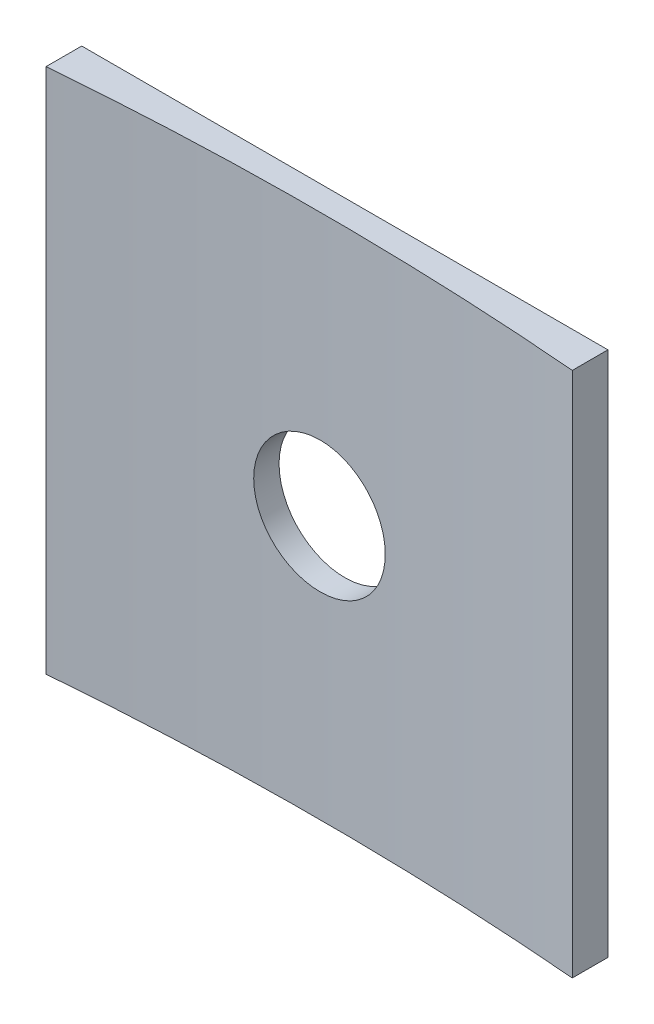
ISO-10303-21;
HEADER;
FILE_DESCRIPTION(('STEP AP214'),'2;1');
FILE_NAME('part.step','',(''),(''),'','','');
FILE_SCHEMA(('AUTOMOTIVE_DESIGN { 1 0 10303 214 1 1 1 1 }'));
ENDSEC;
DATA;
#1=APPLICATION_CONTEXT('core data for automotive mechanical design processes');
#2=APPLICATION_PROTOCOL_DEFINITION('international standard','automotive_design',2000,#1);
#3=PRODUCT_CONTEXT('',#1,'mechanical');
#4=PRODUCT('Part','Part','',(#3));
#5=PRODUCT_RELATED_PRODUCT_CATEGORY('part','',(#4));
#6=PRODUCT_DEFINITION_FORMATION('','',#4);
#7=PRODUCT_DEFINITION_CONTEXT('part definition',#1,'design');
#8=PRODUCT_DEFINITION('design','',#6,#7);
#9=PRODUCT_DEFINITION_SHAPE('','',#8);
#10=(LENGTH_UNIT() NAMED_UNIT(*) SI_UNIT(.MILLI.,.METRE.));
#11=(NAMED_UNIT(*) PLANE_ANGLE_UNIT() SI_UNIT($,.RADIAN.));
#12=(NAMED_UNIT(*) SI_UNIT($,.STERADIAN.) SOLID_ANGLE_UNIT());
#13=UNCERTAINTY_MEASURE_WITH_UNIT(LENGTH_MEASURE(1.E-05),#10,'distance_accuracy_value','');
#14=(GEOMETRIC_REPRESENTATION_CONTEXT(3) GLOBAL_UNCERTAINTY_ASSIGNED_CONTEXT((#13)) GLOBAL_UNIT_ASSIGNED_CONTEXT((#10,
#11,#12)) REPRESENTATION_CONTEXT('',''));
#15=CARTESIAN_POINT('',(0.,0.,0.));
#16=DIRECTION('',(0.,0.,1.));
#17=DIRECTION('',(1.,0.,0.));
#18=AXIS2_PLACEMENT_3D('',#15,#16,#17);
#19=CARTESIAN_POINT('',(0.,-25.4,0.));
#20=DIRECTION('',(0.,1.,0.));
#21=DIRECTION('',(0.,0.,1.));
#22=AXIS2_PLACEMENT_3D('',#19,#20,#21);
#23=CYLINDRICAL_SURFACE('',#22,152.4);
#24=CARTESIAN_POINT('',(-3.175,-12.7,-152.366923493913));
#25=CARTESIAN_POINT('',(-3.1749920986252,-12.8783203798337,-152.366923940762));
#26=CARTESIAN_POINT('',(-3.15992683175384,-13.0567695662421,-152.367239897938));
#27=CARTESIAN_POINT('',(-3.1000383491932,-13.4087519311199,-152.36846991657));
#28=CARTESIAN_POINT('',(-3.05517944647312,-13.5822789535593,-152.36938469528));
#29=CARTESIAN_POINT('',(-2.93698255450984,-13.9192668049938,-152.371708684941));
#30=CARTESIAN_POINT('',(-2.86365832693572,-14.0827324540227,-152.37311765694));
#31=CARTESIAN_POINT('',(-2.69063149875452,-14.3949882174427,-152.376270963536));
#32=CARTESIAN_POINT('',(-2.59093539949493,-14.5437819364496,-152.378015215448));
#33=CARTESIAN_POINT('',(-2.36795868767862,-14.8225601356859,-152.381643153922));
#34=CARTESIAN_POINT('',(-2.24467241532279,-14.9525400889091,-152.383526873878));
#35=CARTESIAN_POINT('',(-1.97802331457526,-15.1899635508147,-152.387221133212));
#36=CARTESIAN_POINT('',(-1.83465969279886,-15.2974061684833,-152.389031669694));
#37=CARTESIAN_POINT('',(-1.53191601878581,-15.486706384046,-152.392375519086));
#38=CARTESIAN_POINT('',(-1.372534809831,-15.5685621324144,-152.393908811953));
#39=CARTESIAN_POINT('',(-1.04228863671553,-15.7043526227995,-152.396525138538));
#40=CARTESIAN_POINT('',(-0.871423706708971,-15.7582874478525,-152.397608173595));
#41=CARTESIAN_POINT('',(-0.52308649704307,-15.836697725036,-152.399201752784));
#42=CARTESIAN_POINT('',(-0.345615180660369,-15.8611774548002,-152.399712380045));
#43=CARTESIAN_POINT('',(0.0109186159938498,-15.8799957970201,-152.400103857121));
#44=CARTESIAN_POINT('',(0.189981091717756,-15.8743344955927,-152.399984708736));
#45=CARTESIAN_POINT('',(0.54458524211617,-15.8330351861322,-152.399130139551));
#46=CARTESIAN_POINT('',(0.720127457995702,-15.7974018227461,-152.398394814236));
#47=CARTESIAN_POINT('',(1.06273772421929,-15.6971770586899,-152.396390888777));
#48=CARTESIAN_POINT('',(1.22980576093812,-15.6325856114612,-152.395122287775));
#49=CARTESIAN_POINT('',(1.5507399909113,-15.4762728840765,-152.392194648686));
#50=CARTESIAN_POINT('',(1.70460514634153,-15.3845494737043,-152.390535579945));
#51=CARTESIAN_POINT('',(1.99475447265447,-15.1765781559269,-152.387014017177));
#52=CARTESIAN_POINT('',(2.13103862784003,-15.0603302266253,-152.385151522969));
#53=CARTESIAN_POINT('',(2.38218444686974,-14.8065834146978,-152.381432632009));
#54=CARTESIAN_POINT('',(2.49704203268128,-14.6690804957832,-152.379576236485));
#55=CARTESIAN_POINT('',(2.70204289911422,-14.376741204736,-152.376079192425));
#56=CARTESIAN_POINT('',(2.79218617615158,-14.2219048300897,-152.37443854392));
#57=CARTESIAN_POINT('',(2.94519907076089,-13.8992916950645,-152.371558001611));
#58=CARTESIAN_POINT('',(3.0080685628991,-13.7315148751759,-152.370318109648));
#59=CARTESIAN_POINT('',(3.10474663395198,-13.3877845080458,-152.368378957879));
#60=CARTESIAN_POINT('',(3.13855525171725,-13.2118309717359,-152.36767969735));
#61=CARTESIAN_POINT('',(3.17614686990949,-12.8567773711966,-152.366900777384));
#62=CARTESIAN_POINT('',(3.17993551495527,-12.6776779048402,-152.366821001466));
#63=CARTESIAN_POINT('',(3.1573943437747,-12.3213853649273,-152.367289741507));
#64=CARTESIAN_POINT('',(3.13106454366545,-12.1441922903507,-152.36783825713));
#65=CARTESIAN_POINT('',(3.04903857048439,-11.796758190714,-152.369501636592));
#66=CARTESIAN_POINT('',(2.99334495657732,-11.6265165612028,-152.370616451077));
#67=CARTESIAN_POINT('',(2.85417491731163,-11.2977994273624,-152.373286705928));
#68=CARTESIAN_POINT('',(2.77069846682816,-11.1393239336739,-152.374842146693));
#69=CARTESIAN_POINT('',(2.57831781837455,-10.8386116628775,-152.378218584074));
#70=CARTESIAN_POINT('',(2.46940981749153,-10.6963773191347,-152.380039620391));
#71=CARTESIAN_POINT('',(2.22926317456083,-10.4322093183167,-152.383741810638));
#72=CARTESIAN_POINT('',(2.09802450037049,-10.3102756904627,-152.385622964656));
#73=CARTESIAN_POINT('',(1.8169177849111,-10.090151637434,-152.38923365395));
#74=CARTESIAN_POINT('',(1.66704689141537,-9.99196485422721,-152.390963165945));
#75=CARTESIAN_POINT('',(1.35294475663512,-9.82214663581258,-152.39407526353));
#76=CARTESIAN_POINT('',(1.18871353881953,-9.75051515720666,-152.395457849686));
#77=CARTESIAN_POINT('',(0.850566469601386,-9.63584725415542,-152.397720120313));
#78=CARTESIAN_POINT('',(0.676651422467755,-9.59280845883615,-152.398599846479));
#79=CARTESIAN_POINT('',(0.324061974118008,-9.53653984473758,-152.399757387774));
#80=CARTESIAN_POINT('',(0.145387570469758,-9.52331004119163,-152.400035202594));
#81=CARTESIAN_POINT('',(-0.211611865014944,-9.52703529544678,-152.399957603087));
#82=CARTESIAN_POINT('',(-0.389936957071266,-9.54398458755496,-152.399602309715));
#83=CARTESIAN_POINT('',(-0.741210124178171,-9.60757510460974,-152.398298776041));
#84=CARTESIAN_POINT('',(-0.914158188486152,-9.65421638887308,-152.397350534555));
#85=CARTESIAN_POINT('',(-1.24977155098012,-9.77586668685811,-152.394967951465));
#86=CARTESIAN_POINT('',(-1.4124366640485,-9.85087621110601,-152.393533601114));
#87=CARTESIAN_POINT('',(-1.7228600606918,-10.0271300866237,-152.390340503903));
#88=CARTESIAN_POINT('',(-1.87061890697541,-10.1283734470559,-152.388581769296));
#89=CARTESIAN_POINT('',(-2.14705798542837,-10.3542316746816,-152.384937868475));
#90=CARTESIAN_POINT('',(-2.27573660154825,-10.4788485195305,-152.38305269157));
#91=CARTESIAN_POINT('',(-2.51038012985537,-10.747952871158,-152.379368034243));
#92=CARTESIAN_POINT('',(-2.61633939894465,-10.8924453000967,-152.377568575197));
#93=CARTESIAN_POINT('',(-2.80254543733462,-11.197239434375,-152.374257813369));
#94=CARTESIAN_POINT('',(-2.88277778510863,-11.3575499411138,-152.372746672397));
#95=CARTESIAN_POINT('',(-3.0150965250472,-11.6892440011975,-152.370186106662));
#96=CARTESIAN_POINT('',(-3.06721657302619,-11.8606140375961,-152.369136130076));
#97=CARTESIAN_POINT('',(-3.12797806838276,-12.1442263371796,-152.367897733141));
#98=CARTESIAN_POINT('',(-3.14558919908283,-12.2546266886159,-152.367533973729));
#99=CARTESIAN_POINT('',(-3.16910263859059,-12.4766678491507,-152.367046714189));
#100=CARTESIAN_POINT('',(-3.17500494904259,-12.588308658075,-152.366923214029));
#101=CARTESIAN_POINT('',(-3.175,-12.7,-152.366923493913));
#102=B_SPLINE_CURVE_WITH_KNOTS('',3,(#24,#25,#26,#27,#28,#29,#30,#31,#32,#33,#34,#35,#36,#37,
#38,#39,#40,#41,#42,#43,#44,#45,#46,#47,#48,#49,#50,#51,#52,#53,#54,#55,#56,#57,#58,#59,#60,#61,
#62,#63,#64,#65,#66,#67,#68,#69,#70,#71,#72,#73,#74,#75,#76,#77,#78,#79,#80,#81,#82,#83,#84,#85,
#86,#87,#88,#89,#90,#91,#92,#93,#94,#95,#96,#97,#98,#99,#100,#101),.UNSPECIFIED.,.T.,.F.,(4,2,2,
2,2,2,2,2,2,2,2,2,2,2,2,2,2,2,2,2,2,2,2,2,2,2,2,2,2,2,2,2,2,2,2,2,2,2,4),(0.,0.534553459243709,
1.06974836800196,1.60468485633052,2.13948959170376,2.67442279969665,3.20937715229556,
3.74437016469157,4.27936158601811,4.81427530351562,5.3491874926945,5.8840168040057,
6.41884697521621,6.95371914878561,7.48859179991102,8.0235661475625,8.55854057279524,
9.09351745838061,9.62849362877031,10.1633692058565,10.6982444967182,11.2330731789282,
11.7679023448013,12.302811537752,12.8377215006549,13.3727134488225,13.9077045226743,
14.4426512301139,14.9775982109282,15.5124430015009,16.0472888605551,16.5821443453676,
17.1169796319278,17.6518601919033,18.1868734535705,18.7221861010044,19.2568564459882,
19.5916751674029,19.9264938417982),.UNSPECIFIED.);
#103=CARTESIAN_POINT('',(-3.175,-12.7,-152.366923493913));
#104=VERTEX_POINT('',#103);
#105=EDGE_CURVE('E113',#104,#104,#102,.T.);
#106=ORIENTED_EDGE('',*,*,#105,.F.);
#107=EDGE_LOOP('',(#106));
#108=FACE_BOUND('',#107,.T.);
#109=CARTESIAN_POINT('',(0.,0.,0.));
#110=DIRECTION('',(0.,-1.,0.));
#111=DIRECTION('',(0.,0.,1.));
#112=AXIS2_PLACEMENT_3D('',#109,#110,#111);
#113=CIRCLE('',#112,152.4);
#114=CARTESIAN_POINT('',(-12.7,0.,-151.869911437388));
#115=VERTEX_POINT('',#114);
#116=CARTESIAN_POINT('',(12.7,0.,-151.869911437388));
#117=VERTEX_POINT('',#116);
#118=EDGE_CURVE('E104',#115,#117,#113,.T.);
#119=ORIENTED_EDGE('',*,*,#118,.F.);
#120=DIRECTION('',(0.,1.,0.));
#121=VECTOR('',#120,1.);
#122=CARTESIAN_POINT('',(-12.7,-25.4,-151.869911437388));
#123=LINE('',#122,#121);
#124=CARTESIAN_POINT('',(-12.7,-25.4,-151.869911437388));
#125=VERTEX_POINT('',#124);
#126=EDGE_CURVE('E11',#125,#115,#123,.T.);
#127=ORIENTED_EDGE('',*,*,#126,.F.);
#128=CARTESIAN_POINT('',(0.,-25.4,0.));
#129=DIRECTION('',(0.,-1.,0.));
#130=DIRECTION('',(0.,0.,-1.));
#131=AXIS2_PLACEMENT_3D('',#128,#129,#130);
#132=CIRCLE('',#131,152.4);
#133=CARTESIAN_POINT('',(12.7,-25.4,-151.869911437388));
#134=VERTEX_POINT('',#133);
#135=EDGE_CURVE('E59',#125,#134,#132,.T.);
#136=ORIENTED_EDGE('',*,*,#135,.T.);
#137=DIRECTION('',(0.,1.,0.));
#138=VECTOR('',#137,1.);
#139=CARTESIAN_POINT('',(12.7,-25.4,-151.869911437388));
#140=LINE('',#139,#138);
#141=EDGE_CURVE('E43',#134,#117,#140,.T.);
#142=ORIENTED_EDGE('',*,*,#141,.T.);
#143=EDGE_LOOP('',(#119,#127,#136,#142));
#144=FACE_BOUND('',#143,.T.);
#145=ADVANCED_FACE('F39',(#108,#144),#23,.F.);
#146=CARTESIAN_POINT('',(-12.7,-25.4,-151.869911437388));
#147=DIRECTION('',(-1.,0.,0.));
#148=DIRECTION('',(0.,0.,1.));
#149=AXIS2_PLACEMENT_3D('',#146,#147,#148);
#150=PLANE('',#149);
#151=DIRECTION('',(0.,0.,1.));
#152=VECTOR('',#151,1.);
#153=CARTESIAN_POINT('',(-12.7,0.,-151.869911437388));
#154=LINE('',#153,#152);
#155=CARTESIAN_POINT('',(-12.7,0.,-153.590837637388));
#156=VERTEX_POINT('',#155);
#157=EDGE_CURVE('E116',#156,#115,#154,.T.);
#158=ORIENTED_EDGE('',*,*,#157,.F.);
#159=DIRECTION('',(0.,1.,0.));
#160=VECTOR('',#159,1.);
#161=CARTESIAN_POINT('',(-12.7,-25.4,-153.590837637388));
#162=LINE('',#161,#160);
#163=CARTESIAN_POINT('',(-12.7,-25.4,-153.590837637388));
#164=VERTEX_POINT('',#163);
#165=EDGE_CURVE('E50',#164,#156,#162,.T.);
#166=ORIENTED_EDGE('',*,*,#165,.F.);
#167=DIRECTION('',(0.,0.,1.));
#168=VECTOR('',#167,1.);
#169=CARTESIAN_POINT('',(-12.7,-25.4,-151.869911437388));
#170=LINE('',#169,#168);
#171=EDGE_CURVE('E98',#164,#125,#170,.T.);
#172=ORIENTED_EDGE('',*,*,#171,.T.);
#173=ORIENTED_EDGE('',*,*,#126,.T.);
#174=EDGE_LOOP('',(#158,#166,#172,#173));
#175=FACE_BOUND('',#174,.T.);
#176=ADVANCED_FACE('F127',(#175),#150,.T.);
#177=CARTESIAN_POINT('',(-12.7,-25.4,-153.590837637388));
#178=DIRECTION('',(0.,0.,-1.));
#179=DIRECTION('',(-1.,0.,0.));
#180=AXIS2_PLACEMENT_3D('',#177,#178,#179);
#181=PLANE('',#180);
#182=CARTESIAN_POINT('',(0.,-12.7,-153.590837637388));
#183=DIRECTION('',(0.,0.,-1.));
#184=DIRECTION('',(-1.,0.,0.));
#185=AXIS2_PLACEMENT_3D('',#182,#183,#184);
#186=CIRCLE('',#185,3.175);
#187=CARTESIAN_POINT('',(-3.175,-12.7,-153.590837637388));
#188=VERTEX_POINT('',#187);
#189=EDGE_CURVE('E147',#188,#188,#186,.T.);
#190=ORIENTED_EDGE('',*,*,#189,.F.);
#191=EDGE_LOOP('',(#190));
#192=FACE_BOUND('',#191,.T.);
#193=DIRECTION('',(-1.,0.,0.));
#194=VECTOR('',#193,1.);
#195=CARTESIAN_POINT('',(-12.7,0.,-153.590837637388));
#196=LINE('',#195,#194);
#197=CARTESIAN_POINT('',(12.7,0.,-153.590837637388));
#198=VERTEX_POINT('',#197);
#199=EDGE_CURVE('E93',#198,#156,#196,.T.);
#200=ORIENTED_EDGE('',*,*,#199,.F.);
#201=DIRECTION('',(0.,1.,0.));
#202=VECTOR('',#201,1.);
#203=CARTESIAN_POINT('',(12.7,-25.4,-153.590837637388));
#204=LINE('',#203,#202);
#205=CARTESIAN_POINT('',(12.7,-25.4,-153.590837637388));
#206=VERTEX_POINT('',#205);
#207=EDGE_CURVE('E88',#206,#198,#204,.T.);
#208=ORIENTED_EDGE('',*,*,#207,.F.);
#209=DIRECTION('',(-1.,0.,0.));
#210=VECTOR('',#209,1.);
#211=CARTESIAN_POINT('',(-12.7,-25.4,-153.590837637388));
#212=LINE('',#211,#210);
#213=EDGE_CURVE('E91',#206,#164,#212,.T.);
#214=ORIENTED_EDGE('',*,*,#213,.T.);
#215=ORIENTED_EDGE('',*,*,#165,.T.);
#216=EDGE_LOOP('',(#200,#208,#214,#215));
#217=FACE_BOUND('',#216,.T.);
#218=ADVANCED_FACE('F90',(#192,#217),#181,.T.);
#219=CARTESIAN_POINT('',(12.7,-25.4,-153.590837637388));
#220=DIRECTION('',(1.,0.,0.));
#221=DIRECTION('',(0.,0.,-1.));
#222=AXIS2_PLACEMENT_3D('',#219,#220,#221);
#223=PLANE('',#222);
#224=DIRECTION('',(0.,0.,-1.));
#225=VECTOR('',#224,1.);
#226=CARTESIAN_POINT('',(12.7,0.,-153.590837637388));
#227=LINE('',#226,#225);
#228=EDGE_CURVE('E110',#117,#198,#227,.T.);
#229=ORIENTED_EDGE('',*,*,#228,.F.);
#230=ORIENTED_EDGE('',*,*,#141,.F.);
#231=DIRECTION('',(0.,0.,-1.));
#232=VECTOR('',#231,1.);
#233=CARTESIAN_POINT('',(12.7,-25.4,-153.590837637388));
#234=LINE('',#233,#232);
#235=EDGE_CURVE('E97',#134,#206,#234,.T.);
#236=ORIENTED_EDGE('',*,*,#235,.T.);
#237=ORIENTED_EDGE('',*,*,#207,.T.);
#238=EDGE_LOOP('',(#229,#230,#236,#237));
#239=FACE_BOUND('',#238,.T.);
#240=ADVANCED_FACE('F41',(#239),#223,.T.);
#241=CARTESIAN_POINT('',(0.,-25.4,0.));
#242=DIRECTION('',(0.,-1.,0.));
#243=DIRECTION('',(0.,0.,-1.));
#244=AXIS2_PLACEMENT_3D('',#241,#242,#243);
#245=PLANE('',#244);
#246=ORIENTED_EDGE('',*,*,#135,.F.);
#247=ORIENTED_EDGE('',*,*,#171,.F.);
#248=ORIENTED_EDGE('',*,*,#213,.F.);
#249=ORIENTED_EDGE('',*,*,#235,.F.);
#250=EDGE_LOOP('',(#246,#247,#248,#249));
#251=FACE_BOUND('',#250,.T.);
#252=ADVANCED_FACE('F96',(#251),#245,.T.);
#253=CARTESIAN_POINT('',(0.,0.,0.));
#254=DIRECTION('',(0.,-1.,0.));
#255=DIRECTION('',(0.,0.,-1.));
#256=AXIS2_PLACEMENT_3D('',#253,#254,#255);
#257=PLANE('',#256);
#258=ORIENTED_EDGE('',*,*,#118,.T.);
#259=ORIENTED_EDGE('',*,*,#228,.T.);
#260=ORIENTED_EDGE('',*,*,#199,.T.);
#261=ORIENTED_EDGE('',*,*,#157,.T.);
#262=EDGE_LOOP('',(#258,#259,#260,#261));
#263=FACE_BOUND('',#262,.T.);
#264=ADVANCED_FACE('F126',(#263),#257,.F.);
#265=CARTESIAN_POINT('',(0.,-12.7,-151.869911437388));
#266=DIRECTION('',(0.,0.,-1.));
#267=DIRECTION('',(-1.,0.,0.));
#268=AXIS2_PLACEMENT_3D('',#265,#266,#267);
#269=CYLINDRICAL_SURFACE('',#268,3.175);
#270=ORIENTED_EDGE('',*,*,#105,.T.);
#271=EDGE_LOOP('',(#270));
#272=FACE_BOUND('',#271,.T.);
#273=ORIENTED_EDGE('',*,*,#189,.T.);
#274=EDGE_LOOP('',(#273));
#275=FACE_BOUND('',#274,.T.);
#276=ADVANCED_FACE('F148',(#272,#275),#269,.F.);
#277=CLOSED_SHELL('',(#145,#176,#218,#240,#252,#264,#276));
#278=MANIFOLD_SOLID_BREP('B2',#277);
#279=ADVANCED_BREP_SHAPE_REPRESENTATION('',(#18,#278),#14);
#280=SHAPE_DEFINITION_REPRESENTATION(#9,#279);
ENDSEC;
END-ISO-10303-21;
